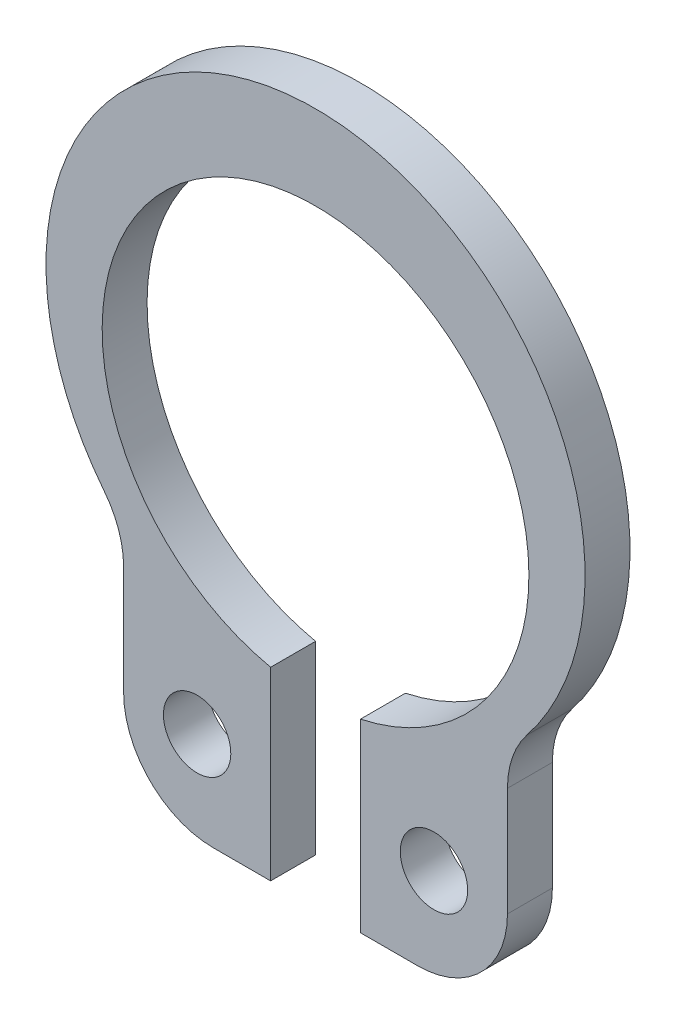
ISO-10303-21;
HEADER;
FILE_DESCRIPTION(('STEP AP214'),'2;1');
FILE_NAME('part.step','',(''),(''),'','','');
FILE_SCHEMA(('AUTOMOTIVE_DESIGN { 1 0 10303 214 1 1 1 1 }'));
ENDSEC;
DATA;
#1=APPLICATION_CONTEXT('core data for automotive mechanical design processes');
#2=APPLICATION_PROTOCOL_DEFINITION('international standard','automotive_design',2000,#1);
#3=PRODUCT_CONTEXT('',#1,'mechanical');
#4=PRODUCT('Part','Part','',(#3));
#5=PRODUCT_RELATED_PRODUCT_CATEGORY('part','',(#4));
#6=PRODUCT_DEFINITION_FORMATION('','',#4);
#7=PRODUCT_DEFINITION_CONTEXT('part definition',#1,'design');
#8=PRODUCT_DEFINITION('design','',#6,#7);
#9=PRODUCT_DEFINITION_SHAPE('','',#8);
#10=(LENGTH_UNIT() NAMED_UNIT(*) SI_UNIT(.MILLI.,.METRE.));
#11=(NAMED_UNIT(*) PLANE_ANGLE_UNIT() SI_UNIT($,.RADIAN.));
#12=(NAMED_UNIT(*) SI_UNIT($,.STERADIAN.) SOLID_ANGLE_UNIT());
#13=UNCERTAINTY_MEASURE_WITH_UNIT(LENGTH_MEASURE(1.E-05),#10,'distance_accuracy_value','');
#14=(GEOMETRIC_REPRESENTATION_CONTEXT(3) GLOBAL_UNCERTAINTY_ASSIGNED_CONTEXT((#13)) GLOBAL_UNIT_ASSIGNED_CONTEXT((#10,
#11,#12)) REPRESENTATION_CONTEXT('',''));
#15=CARTESIAN_POINT('',(0.,0.,0.));
#16=DIRECTION('',(0.,0.,1.));
#17=DIRECTION('',(1.,0.,0.));
#18=AXIS2_PLACEMENT_3D('',#15,#16,#17);
#19=CARTESIAN_POINT('',(-5.01789327655527,-3.47249884393959,0.8));
#20=DIRECTION('',(0.,0.,-1.));
#21=DIRECTION('',(-1.,0.,0.));
#22=AXIS2_PLACEMENT_3D('',#19,#20,#21);
#23=CYLINDRICAL_SURFACE('',#22,1.6);
#24=CARTESIAN_POINT('',(-5.01789327655527,-3.47249884393959,0.));
#25=DIRECTION('',(0.,0.,1.));
#26=DIRECTION('',(1.,0.,0.));
#27=AXIS2_PLACEMENT_3D('',#24,#25,#26);
#28=CIRCLE('',#27,1.6);
#29=CARTESIAN_POINT('',(-3.41789327655527,-3.47249884393959,0.));
#30=VERTEX_POINT('',#29);
#31=CARTESIAN_POINT('',(-3.76341995741646,-2.47937413295469,0.));
#32=VERTEX_POINT('',#31);
#33=EDGE_CURVE('E125',#30,#32,#28,.T.);
#34=ORIENTED_EDGE('',*,*,#33,.F.);
#35=DIRECTION('',(0.,0.,-1.));
#36=VECTOR('',#35,1.);
#37=CARTESIAN_POINT('',(-3.41789327655527,-3.47249884393959,0.8));
#38=LINE('',#37,#36);
#39=CARTESIAN_POINT('',(-3.41789327655527,-3.47249884393959,0.8));
#40=VERTEX_POINT('',#39);
#41=EDGE_CURVE('E11',#40,#30,#38,.T.);
#42=ORIENTED_EDGE('',*,*,#41,.F.);
#43=CARTESIAN_POINT('',(-5.01789327655527,-3.47249884393959,0.8));
#44=DIRECTION('',(0.,0.,1.));
#45=DIRECTION('',(1.,0.,0.));
#46=AXIS2_PLACEMENT_3D('',#43,#44,#45);
#47=CIRCLE('',#46,1.6);
#48=CARTESIAN_POINT('',(-3.76341995741646,-2.47937413295469,0.8));
#49=VERTEX_POINT('',#48);
#50=EDGE_CURVE('E168',#40,#49,#47,.T.);
#51=ORIENTED_EDGE('',*,*,#50,.T.);
#52=DIRECTION('',(0.,0.,-1.));
#53=VECTOR('',#52,1.);
#54=CARTESIAN_POINT('',(-3.76341995741646,-2.47937413295469,0.8));
#55=LINE('',#54,#53);
#56=EDGE_CURVE('E118',#49,#32,#55,.T.);
#57=ORIENTED_EDGE('',*,*,#56,.T.);
#58=EDGE_LOOP('',(#34,#42,#51,#57));
#59=FACE_BOUND('',#58,.T.);
#60=ADVANCED_FACE('F16',(#59),#23,.F.);
#61=CARTESIAN_POINT('',(-3.41789327655527,-3.47249884393959,0.8));
#62=DIRECTION('',(1.,0.,0.));
#63=DIRECTION('',(0.,0.,-1.));
#64=AXIS2_PLACEMENT_3D('',#61,#62,#63);
#65=PLANE('',#64);
#66=DIRECTION('',(0.,-1.,0.));
#67=VECTOR('',#66,1.);
#68=CARTESIAN_POINT('',(-3.41789327655527,-3.47249884393959,0.));
#69=LINE('',#68,#67);
#70=CARTESIAN_POINT('',(-3.41789327655527,-5.41,0.));
#71=VERTEX_POINT('',#70);
#72=EDGE_CURVE('E165',#30,#71,#69,.T.);
#73=ORIENTED_EDGE('',*,*,#72,.T.);
#74=DIRECTION('',(0.,0.,-1.));
#75=VECTOR('',#74,1.);
#76=CARTESIAN_POINT('',(-3.41789327655527,-5.41,0.8));
#77=LINE('',#76,#75);
#78=CARTESIAN_POINT('',(-3.41789327655527,-5.41,0.8));
#79=VERTEX_POINT('',#78);
#80=EDGE_CURVE('E25',#79,#71,#77,.T.);
#81=ORIENTED_EDGE('',*,*,#80,.F.);
#82=DIRECTION('',(0.,-1.,0.));
#83=VECTOR('',#82,1.);
#84=CARTESIAN_POINT('',(-3.41789327655527,-3.47249884393959,0.8));
#85=LINE('',#84,#83);
#86=EDGE_CURVE('E38',#40,#79,#85,.T.);
#87=ORIENTED_EDGE('',*,*,#86,.F.);
#88=ORIENTED_EDGE('',*,*,#41,.T.);
#89=EDGE_LOOP('',(#73,#81,#87,#88));
#90=FACE_BOUND('',#89,.T.);
#91=ADVANCED_FACE('F277',(#90),#65,.F.);
#92=CARTESIAN_POINT('',(-1.81789327655528,-5.41,0.8));
#93=DIRECTION('',(0.,0.,-1.));
#94=DIRECTION('',(-1.,0.,0.));
#95=AXIS2_PLACEMENT_3D('',#92,#93,#94);
#96=CYLINDRICAL_SURFACE('',#95,1.6);
#97=CARTESIAN_POINT('',(-1.81789327655528,-5.41,0.));
#98=DIRECTION('',(0.,0.,1.));
#99=DIRECTION('',(1.,0.,0.));
#100=AXIS2_PLACEMENT_3D('',#97,#98,#99);
#101=CIRCLE('',#100,1.6);
#102=CARTESIAN_POINT('',(-1.81789327655528,-7.01,0.));
#103=VERTEX_POINT('',#102);
#104=EDGE_CURVE('E162',#71,#103,#101,.T.);
#105=ORIENTED_EDGE('',*,*,#104,.T.);
#106=DIRECTION('',(0.,0.,-1.));
#107=VECTOR('',#106,1.);
#108=CARTESIAN_POINT('',(-1.81789327655528,-7.01,0.8));
#109=LINE('',#108,#107);
#110=CARTESIAN_POINT('',(-1.81789327655528,-7.01,0.8));
#111=VERTEX_POINT('',#110);
#112=EDGE_CURVE('E210',#111,#103,#109,.T.);
#113=ORIENTED_EDGE('',*,*,#112,.F.);
#114=CARTESIAN_POINT('',(-1.81789327655528,-5.41,0.8));
#115=DIRECTION('',(0.,0.,1.));
#116=DIRECTION('',(1.,0.,0.));
#117=AXIS2_PLACEMENT_3D('',#114,#115,#116);
#118=CIRCLE('',#117,1.6);
#119=EDGE_CURVE('E200',#79,#111,#118,.T.);
#120=ORIENTED_EDGE('',*,*,#119,.F.);
#121=ORIENTED_EDGE('',*,*,#80,.T.);
#122=EDGE_LOOP('',(#105,#113,#120,#121));
#123=FACE_BOUND('',#122,.T.);
#124=ADVANCED_FACE('F274',(#123),#96,.T.);
#125=CARTESIAN_POINT('',(-1.81789327655528,-7.01,0.8));
#126=DIRECTION('',(0.,1.,0.));
#127=DIRECTION('',(0.,0.,1.));
#128=AXIS2_PLACEMENT_3D('',#125,#126,#127);
#129=PLANE('',#128);
#130=DIRECTION('',(1.,0.,0.));
#131=VECTOR('',#130,1.);
#132=CARTESIAN_POINT('',(-1.81789327655528,-7.01,0.));
#133=LINE('',#132,#131);
#134=CARTESIAN_POINT('',(-0.8,-7.01,0.));
#135=VERTEX_POINT('',#134);
#136=EDGE_CURVE('E159',#103,#135,#133,.T.);
#137=ORIENTED_EDGE('',*,*,#136,.T.);
#138=DIRECTION('',(0.,0.,-1.));
#139=VECTOR('',#138,1.);
#140=CARTESIAN_POINT('',(-0.8,-7.01,0.8));
#141=LINE('',#140,#139);
#142=CARTESIAN_POINT('',(-0.8,-7.01,0.8));
#143=VERTEX_POINT('',#142);
#144=EDGE_CURVE('E214',#143,#135,#141,.T.);
#145=ORIENTED_EDGE('',*,*,#144,.F.);
#146=DIRECTION('',(1.,0.,0.));
#147=VECTOR('',#146,1.);
#148=CARTESIAN_POINT('',(-1.81789327655528,-7.01,0.8));
#149=LINE('',#148,#147);
#150=EDGE_CURVE('E197',#111,#143,#149,.T.);
#151=ORIENTED_EDGE('',*,*,#150,.F.);
#152=ORIENTED_EDGE('',*,*,#112,.T.);
#153=EDGE_LOOP('',(#137,#145,#151,#152));
#154=FACE_BOUND('',#153,.T.);
#155=ADVANCED_FACE('F270',(#154),#129,.F.);
#156=CARTESIAN_POINT('',(-0.8,-7.01,0.8));
#157=DIRECTION('',(-1.,0.,0.));
#158=DIRECTION('',(0.,-1.,0.));
#159=AXIS2_PLACEMENT_3D('',#156,#157,#158);
#160=PLANE('',#159);
#161=DIRECTION('',(0.,1.,0.));
#162=VECTOR('',#161,1.);
#163=CARTESIAN_POINT('',(-0.8,-7.01,0.));
#164=LINE('',#163,#162);
#165=CARTESIAN_POINT('',(-0.8,-3.71483512420135,0.));
#166=VERTEX_POINT('',#165);
#167=EDGE_CURVE('E155',#135,#166,#164,.T.);
#168=ORIENTED_EDGE('',*,*,#167,.T.);
#169=DIRECTION('',(0.,0.,-1.));
#170=VECTOR('',#169,1.);
#171=CARTESIAN_POINT('',(-0.8,-3.71483512420135,0.8));
#172=LINE('',#171,#170);
#173=CARTESIAN_POINT('',(-0.8,-3.71483512420135,0.8));
#174=VERTEX_POINT('',#173);
#175=EDGE_CURVE('E218',#174,#166,#172,.T.);
#176=ORIENTED_EDGE('',*,*,#175,.F.);
#177=DIRECTION('',(0.,1.,0.));
#178=VECTOR('',#177,1.);
#179=CARTESIAN_POINT('',(-0.8,-7.01,0.8));
#180=LINE('',#179,#178);
#181=EDGE_CURVE('E194',#143,#174,#180,.T.);
#182=ORIENTED_EDGE('',*,*,#181,.F.);
#183=ORIENTED_EDGE('',*,*,#144,.T.);
#184=EDGE_LOOP('',(#168,#176,#182,#183));
#185=FACE_BOUND('',#184,.T.);
#186=ADVANCED_FACE('F266',(#185),#160,.F.);
#187=CARTESIAN_POINT('',(0.,0.,0.8));
#188=DIRECTION('',(0.,0.,-1.));
#189=DIRECTION('',(-1.,0.,0.));
#190=AXIS2_PLACEMENT_3D('',#187,#188,#189);
#191=CYLINDRICAL_SURFACE('',#190,3.8);
#192=CARTESIAN_POINT('',(0.,0.,0.));
#193=DIRECTION('',(0.,0.,1.));
#194=DIRECTION('',(1.,0.,0.));
#195=AXIS2_PLACEMENT_3D('',#192,#193,#194);
#196=CIRCLE('',#195,3.8);
#197=CARTESIAN_POINT('',(0.8,-3.71483512420135,0.));
#198=VERTEX_POINT('',#197);
#199=EDGE_CURVE('E151',#198,#166,#196,.T.);
#200=ORIENTED_EDGE('',*,*,#199,.F.);
#201=DIRECTION('',(0.,0.,-1.));
#202=VECTOR('',#201,1.);
#203=CARTESIAN_POINT('',(0.8,-3.71483512420135,0.8));
#204=LINE('',#203,#202);
#205=CARTESIAN_POINT('',(0.8,-3.71483512420135,0.8));
#206=VERTEX_POINT('',#205);
#207=EDGE_CURVE('E221',#206,#198,#204,.T.);
#208=ORIENTED_EDGE('',*,*,#207,.F.);
#209=CARTESIAN_POINT('',(0.,0.,0.8));
#210=DIRECTION('',(0.,0.,1.));
#211=DIRECTION('',(1.,0.,0.));
#212=AXIS2_PLACEMENT_3D('',#209,#210,#211);
#213=CIRCLE('',#212,3.8);
#214=EDGE_CURVE('E190',#206,#174,#213,.T.);
#215=ORIENTED_EDGE('',*,*,#214,.T.);
#216=ORIENTED_EDGE('',*,*,#175,.T.);
#217=EDGE_LOOP('',(#200,#208,#215,#216));
#218=FACE_BOUND('',#217,.T.);
#219=ADVANCED_FACE('F261',(#218),#191,.F.);
#220=CARTESIAN_POINT('',(0.8,-7.01,0.8));
#221=DIRECTION('',(-1.,0.,0.));
#222=DIRECTION('',(0.,-1.,0.));
#223=AXIS2_PLACEMENT_3D('',#220,#221,#222);
#224=PLANE('',#223);
#225=DIRECTION('',(0.,1.,0.));
#226=VECTOR('',#225,1.);
#227=CARTESIAN_POINT('',(0.8,-7.01,0.));
#228=LINE('',#227,#226);
#229=CARTESIAN_POINT('',(0.8,-7.01,0.));
#230=VERTEX_POINT('',#229);
#231=EDGE_CURVE('E147',#230,#198,#228,.T.);
#232=ORIENTED_EDGE('',*,*,#231,.F.);
#233=DIRECTION('',(0.,0.,-1.));
#234=VECTOR('',#233,1.);
#235=CARTESIAN_POINT('',(0.8,-7.01,0.8));
#236=LINE('',#235,#234);
#237=CARTESIAN_POINT('',(0.8,-7.01,0.8));
#238=VERTEX_POINT('',#237);
#239=EDGE_CURVE('E224',#238,#230,#236,.T.);
#240=ORIENTED_EDGE('',*,*,#239,.F.);
#241=DIRECTION('',(0.,1.,0.));
#242=VECTOR('',#241,1.);
#243=CARTESIAN_POINT('',(0.8,-7.01,0.8));
#244=LINE('',#243,#242);
#245=EDGE_CURVE('E186',#238,#206,#244,.T.);
#246=ORIENTED_EDGE('',*,*,#245,.T.);
#247=ORIENTED_EDGE('',*,*,#207,.T.);
#248=EDGE_LOOP('',(#232,#240,#246,#247));
#249=FACE_BOUND('',#248,.T.);
#250=ADVANCED_FACE('F256',(#249),#224,.T.);
#251=CARTESIAN_POINT('',(0.8,-7.01,0.8));
#252=DIRECTION('',(0.,1.,0.));
#253=DIRECTION('',(0.,0.,1.));
#254=AXIS2_PLACEMENT_3D('',#251,#252,#253);
#255=PLANE('',#254);
#256=DIRECTION('',(1.,0.,0.));
#257=VECTOR('',#256,1.);
#258=CARTESIAN_POINT('',(0.8,-7.01,0.));
#259=LINE('',#258,#257);
#260=CARTESIAN_POINT('',(1.81789327655528,-7.01,0.));
#261=VERTEX_POINT('',#260);
#262=EDGE_CURVE('E144',#230,#261,#259,.T.);
#263=ORIENTED_EDGE('',*,*,#262,.T.);
#264=DIRECTION('',(0.,0.,-1.));
#265=VECTOR('',#264,1.);
#266=CARTESIAN_POINT('',(1.81789327655528,-7.01,0.8));
#267=LINE('',#266,#265);
#268=CARTESIAN_POINT('',(1.81789327655528,-7.01,0.8));
#269=VERTEX_POINT('',#268);
#270=EDGE_CURVE('E227',#269,#261,#267,.T.);
#271=ORIENTED_EDGE('',*,*,#270,.F.);
#272=DIRECTION('',(1.,0.,0.));
#273=VECTOR('',#272,1.);
#274=CARTESIAN_POINT('',(0.8,-7.01,0.8));
#275=LINE('',#274,#273);
#276=EDGE_CURVE('E183',#238,#269,#275,.T.);
#277=ORIENTED_EDGE('',*,*,#276,.F.);
#278=ORIENTED_EDGE('',*,*,#239,.T.);
#279=EDGE_LOOP('',(#263,#271,#277,#278));
#280=FACE_BOUND('',#279,.T.);
#281=ADVANCED_FACE('F253',(#280),#255,.F.);
#282=CARTESIAN_POINT('',(1.81789327655528,-5.41,0.8));
#283=DIRECTION('',(0.,0.,-1.));
#284=DIRECTION('',(-1.,0.,0.));
#285=AXIS2_PLACEMENT_3D('',#282,#283,#284);
#286=CYLINDRICAL_SURFACE('',#285,1.6);
#287=CARTESIAN_POINT('',(1.81789327655528,-5.41,0.));
#288=DIRECTION('',(0.,0.,1.));
#289=DIRECTION('',(1.,0.,0.));
#290=AXIS2_PLACEMENT_3D('',#287,#288,#289);
#291=CIRCLE('',#290,1.6);
#292=CARTESIAN_POINT('',(3.41789327655527,-5.41,0.));
#293=VERTEX_POINT('',#292);
#294=EDGE_CURVE('E138',#261,#293,#291,.T.);
#295=ORIENTED_EDGE('',*,*,#294,.T.);
#296=DIRECTION('',(0.,0.,-1.));
#297=VECTOR('',#296,1.);
#298=CARTESIAN_POINT('',(3.41789327655527,-5.41,0.8));
#299=LINE('',#298,#297);
#300=CARTESIAN_POINT('',(3.41789327655527,-5.41,0.8));
#301=VERTEX_POINT('',#300);
#302=EDGE_CURVE('E231',#301,#293,#299,.T.);
#303=ORIENTED_EDGE('',*,*,#302,.F.);
#304=CARTESIAN_POINT('',(1.81789327655528,-5.41,0.8));
#305=DIRECTION('',(0.,0.,1.));
#306=DIRECTION('',(1.,0.,0.));
#307=AXIS2_PLACEMENT_3D('',#304,#305,#306);
#308=CIRCLE('',#307,1.6);
#309=EDGE_CURVE('E180',#269,#301,#308,.T.);
#310=ORIENTED_EDGE('',*,*,#309,.F.);
#311=ORIENTED_EDGE('',*,*,#270,.T.);
#312=EDGE_LOOP('',(#295,#303,#310,#311));
#313=FACE_BOUND('',#312,.T.);
#314=ADVANCED_FACE('F249',(#313),#286,.T.);
#315=CARTESIAN_POINT('',(3.41789327655527,-5.41,0.8));
#316=DIRECTION('',(-1.,0.,0.));
#317=DIRECTION('',(0.,-1.,0.));
#318=AXIS2_PLACEMENT_3D('',#315,#316,#317);
#319=PLANE('',#318);
#320=DIRECTION('',(0.,1.,0.));
#321=VECTOR('',#320,1.);
#322=CARTESIAN_POINT('',(3.41789327655527,-5.41,0.));
#323=LINE('',#322,#321);
#324=CARTESIAN_POINT('',(3.41789327655527,-3.47249884393959,0.));
#325=VERTEX_POINT('',#324);
#326=EDGE_CURVE('E132',#293,#325,#323,.T.);
#327=ORIENTED_EDGE('',*,*,#326,.T.);
#328=DIRECTION('',(0.,0.,-1.));
#329=VECTOR('',#328,1.);
#330=CARTESIAN_POINT('',(3.41789327655527,-3.47249884393959,0.8));
#331=LINE('',#330,#329);
#332=CARTESIAN_POINT('',(3.41789327655527,-3.47249884393959,0.8));
#333=VERTEX_POINT('',#332);
#334=EDGE_CURVE('E117',#333,#325,#331,.T.);
#335=ORIENTED_EDGE('',*,*,#334,.F.);
#336=DIRECTION('',(0.,1.,0.));
#337=VECTOR('',#336,1.);
#338=CARTESIAN_POINT('',(3.41789327655527,-5.41,0.8));
#339=LINE('',#338,#337);
#340=EDGE_CURVE('E177',#301,#333,#339,.T.);
#341=ORIENTED_EDGE('',*,*,#340,.F.);
#342=ORIENTED_EDGE('',*,*,#302,.T.);
#343=EDGE_LOOP('',(#327,#335,#341,#342));
#344=FACE_BOUND('',#343,.T.);
#345=ADVANCED_FACE('F244',(#344),#319,.F.);
#346=CARTESIAN_POINT('',(5.01789327655527,-3.47249884393959,0.8));
#347=DIRECTION('',(0.,0.,-1.));
#348=DIRECTION('',(-1.,0.,0.));
#349=AXIS2_PLACEMENT_3D('',#346,#347,#348);
#350=CYLINDRICAL_SURFACE('',#349,1.6);
#351=CARTESIAN_POINT('',(5.01789327655527,-3.47249884393959,0.));
#352=DIRECTION('',(0.,0.,1.));
#353=DIRECTION('',(1.,0.,0.));
#354=AXIS2_PLACEMENT_3D('',#351,#352,#353);
#355=CIRCLE('',#354,1.6);
#356=CARTESIAN_POINT('',(3.76341995741646,-2.47937413295469,0.));
#357=VERTEX_POINT('',#356);
#358=EDGE_CURVE('E123',#357,#325,#355,.T.);
#359=ORIENTED_EDGE('',*,*,#358,.F.);
#360=DIRECTION('',(0.,0.,-1.));
#361=VECTOR('',#360,1.);
#362=CARTESIAN_POINT('',(3.76341995741646,-2.47937413295469,0.8));
#363=LINE('',#362,#361);
#364=CARTESIAN_POINT('',(3.76341995741646,-2.47937413295469,0.8));
#365=VERTEX_POINT('',#364);
#366=EDGE_CURVE('E19',#365,#357,#363,.T.);
#367=ORIENTED_EDGE('',*,*,#366,.F.);
#368=CARTESIAN_POINT('',(5.01789327655527,-3.47249884393959,0.8));
#369=DIRECTION('',(0.,0.,1.));
#370=DIRECTION('',(1.,0.,0.));
#371=AXIS2_PLACEMENT_3D('',#368,#369,#370);
#372=CIRCLE('',#371,1.6);
#373=EDGE_CURVE('E174',#365,#333,#372,.T.);
#374=ORIENTED_EDGE('',*,*,#373,.T.);
#375=ORIENTED_EDGE('',*,*,#334,.T.);
#376=EDGE_LOOP('',(#359,#367,#374,#375));
#377=FACE_BOUND('',#376,.T.);
#378=ADVANCED_FACE('F128',(#377),#350,.F.);
#379=CARTESIAN_POINT('',(0.,0.5,0.8));
#380=DIRECTION('',(0.,0.,-1.));
#381=DIRECTION('',(-1.,0.,0.));
#382=AXIS2_PLACEMENT_3D('',#379,#380,#381);
#383=CYLINDRICAL_SURFACE('',#382,4.8);
#384=CARTESIAN_POINT('',(0.,0.5,0.));
#385=DIRECTION('',(0.,0.,1.));
#386=DIRECTION('',(1.,0.,0.));
#387=AXIS2_PLACEMENT_3D('',#384,#385,#386);
#388=CIRCLE('',#387,4.8);
#389=EDGE_CURVE('E109',#357,#32,#388,.T.);
#390=ORIENTED_EDGE('',*,*,#389,.T.);
#391=ORIENTED_EDGE('',*,*,#56,.F.);
#392=CARTESIAN_POINT('',(0.,0.5,0.8));
#393=DIRECTION('',(0.,0.,1.));
#394=DIRECTION('',(1.,0.,0.));
#395=AXIS2_PLACEMENT_3D('',#392,#393,#394);
#396=CIRCLE('',#395,4.8);
#397=EDGE_CURVE('E111',#365,#49,#396,.T.);
#398=ORIENTED_EDGE('',*,*,#397,.F.);
#399=ORIENTED_EDGE('',*,*,#366,.T.);
#400=EDGE_LOOP('',(#390,#391,#398,#399));
#401=FACE_BOUND('',#400,.T.);
#402=ADVANCED_FACE('F107',(#401),#383,.T.);
#403=CARTESIAN_POINT('',(-5.01789327655527,-3.47249884393959,0.8));
#404=DIRECTION('',(0.,0.,1.));
#405=DIRECTION('',(1.,0.,0.));
#406=AXIS2_PLACEMENT_3D('',#403,#404,#405);
#407=PLANE('',#406);
#408=CARTESIAN_POINT('',(-2.10894663827764,-5.4,0.8));
#409=DIRECTION('',(0.,0.,-1.));
#410=DIRECTION('',(0.,1.,0.));
#411=AXIS2_PLACEMENT_3D('',#408,#409,#410);
#412=CIRCLE('',#411,0.6);
#413=CARTESIAN_POINT('',(-2.10894663827764,-4.8,0.8));
#414=VERTEX_POINT('',#413);
#415=EDGE_CURVE('E317',#414,#414,#412,.T.);
#416=ORIENTED_EDGE('',*,*,#415,.T.);
#417=EDGE_LOOP('',(#416));
#418=FACE_BOUND('',#417,.T.);
#419=CARTESIAN_POINT('',(2.10894663827764,-5.4,0.8));
#420=DIRECTION('',(0.,0.,-1.));
#421=DIRECTION('',(0.,1.,0.));
#422=AXIS2_PLACEMENT_3D('',#419,#420,#421);
#423=CIRCLE('',#422,0.6);
#424=CARTESIAN_POINT('',(2.10894663827764,-4.8,0.8));
#425=VERTEX_POINT('',#424);
#426=EDGE_CURVE('E171',#425,#425,#423,.T.);
#427=ORIENTED_EDGE('',*,*,#426,.T.);
#428=EDGE_LOOP('',(#427));
#429=FACE_BOUND('',#428,.T.);
#430=ORIENTED_EDGE('',*,*,#50,.F.);
#431=ORIENTED_EDGE('',*,*,#86,.T.);
#432=ORIENTED_EDGE('',*,*,#119,.T.);
#433=ORIENTED_EDGE('',*,*,#150,.T.);
#434=ORIENTED_EDGE('',*,*,#181,.T.);
#435=ORIENTED_EDGE('',*,*,#214,.F.);
#436=ORIENTED_EDGE('',*,*,#245,.F.);
#437=ORIENTED_EDGE('',*,*,#276,.T.);
#438=ORIENTED_EDGE('',*,*,#309,.T.);
#439=ORIENTED_EDGE('',*,*,#340,.T.);
#440=ORIENTED_EDGE('',*,*,#373,.F.);
#441=ORIENTED_EDGE('',*,*,#397,.T.);
#442=EDGE_LOOP('',(#430,#431,#432,#433,#434,#435,#436,#437,#438,#439,#440,#441));
#443=FACE_BOUND('',#442,.T.);
#444=ADVANCED_FACE('F239',(#418,#429,#443),#407,.T.);
#445=CARTESIAN_POINT('',(-5.01789327655527,-3.47249884393959,0.));
#446=DIRECTION('',(0.,0.,1.));
#447=DIRECTION('',(1.,0.,0.));
#448=AXIS2_PLACEMENT_3D('',#445,#446,#447);
#449=PLANE('',#448);
#450=CARTESIAN_POINT('',(-2.10894663827764,-5.4,0.));
#451=DIRECTION('',(0.,0.,1.));
#452=DIRECTION('',(0.,1.,0.));
#453=AXIS2_PLACEMENT_3D('',#450,#451,#452);
#454=CIRCLE('',#453,0.6);
#455=CARTESIAN_POINT('',(-2.10894663827764,-4.8,0.));
#456=VERTEX_POINT('',#455);
#457=EDGE_CURVE('E331',#456,#456,#454,.T.);
#458=ORIENTED_EDGE('',*,*,#457,.T.);
#459=EDGE_LOOP('',(#458));
#460=FACE_BOUND('',#459,.T.);
#461=CARTESIAN_POINT('',(2.10894663827764,-5.4,0.));
#462=DIRECTION('',(0.,0.,1.));
#463=DIRECTION('',(0.,1.,0.));
#464=AXIS2_PLACEMENT_3D('',#461,#462,#463);
#465=CIRCLE('',#464,0.6);
#466=CARTESIAN_POINT('',(2.10894663827764,-4.8,0.));
#467=VERTEX_POINT('',#466);
#468=EDGE_CURVE('E322',#467,#467,#465,.T.);
#469=ORIENTED_EDGE('',*,*,#468,.T.);
#470=EDGE_LOOP('',(#469));
#471=FACE_BOUND('',#470,.T.);
#472=ORIENTED_EDGE('',*,*,#33,.T.);
#473=ORIENTED_EDGE('',*,*,#389,.F.);
#474=ORIENTED_EDGE('',*,*,#358,.T.);
#475=ORIENTED_EDGE('',*,*,#326,.F.);
#476=ORIENTED_EDGE('',*,*,#294,.F.);
#477=ORIENTED_EDGE('',*,*,#262,.F.);
#478=ORIENTED_EDGE('',*,*,#231,.T.);
#479=ORIENTED_EDGE('',*,*,#199,.T.);
#480=ORIENTED_EDGE('',*,*,#167,.F.);
#481=ORIENTED_EDGE('',*,*,#136,.F.);
#482=ORIENTED_EDGE('',*,*,#104,.F.);
#483=ORIENTED_EDGE('',*,*,#72,.F.);
#484=EDGE_LOOP('',(#472,#473,#474,#475,#476,#477,#478,#479,#480,#481,#482,#483));
#485=FACE_BOUND('',#484,.T.);
#486=ADVANCED_FACE('F121',(#460,#471,#485),#449,.F.);
#487=CARTESIAN_POINT('',(2.10894663827764,-5.4,0.));
#488=DIRECTION('',(0.,0.,1.));
#489=DIRECTION('',(0.,1.,0.));
#490=AXIS2_PLACEMENT_3D('',#487,#488,#489);
#491=CYLINDRICAL_SURFACE('',#490,0.6);
#492=ORIENTED_EDGE('',*,*,#426,.F.);
#493=EDGE_LOOP('',(#492));
#494=FACE_BOUND('',#493,.T.);
#495=ORIENTED_EDGE('',*,*,#468,.F.);
#496=EDGE_LOOP('',(#495));
#497=FACE_BOUND('',#496,.T.);
#498=ADVANCED_FACE('F312',(#494,#497),#491,.F.);
#499=CARTESIAN_POINT('',(-2.10894663827764,-5.4,0.));
#500=DIRECTION('',(0.,0.,1.));
#501=DIRECTION('',(0.,1.,0.));
#502=AXIS2_PLACEMENT_3D('',#499,#500,#501);
#503=CYLINDRICAL_SURFACE('',#502,0.6);
#504=ORIENTED_EDGE('',*,*,#415,.F.);
#505=EDGE_LOOP('',(#504));
#506=FACE_BOUND('',#505,.T.);
#507=ORIENTED_EDGE('',*,*,#457,.F.);
#508=EDGE_LOOP('',(#507));
#509=FACE_BOUND('',#508,.T.);
#510=ADVANCED_FACE('F338',(#506,#509),#503,.F.);
#511=CLOSED_SHELL('',(#60,#91,#124,#155,#186,#219,#250,#281,#314,#345,#378,#402,#444,#486,#498,#510));
#512=MANIFOLD_SOLID_BREP('B1',#511);
#513=ADVANCED_BREP_SHAPE_REPRESENTATION('',(#18,#512),#14);
#514=SHAPE_DEFINITION_REPRESENTATION(#9,#513);
ENDSEC;
END-ISO-10303-21;
